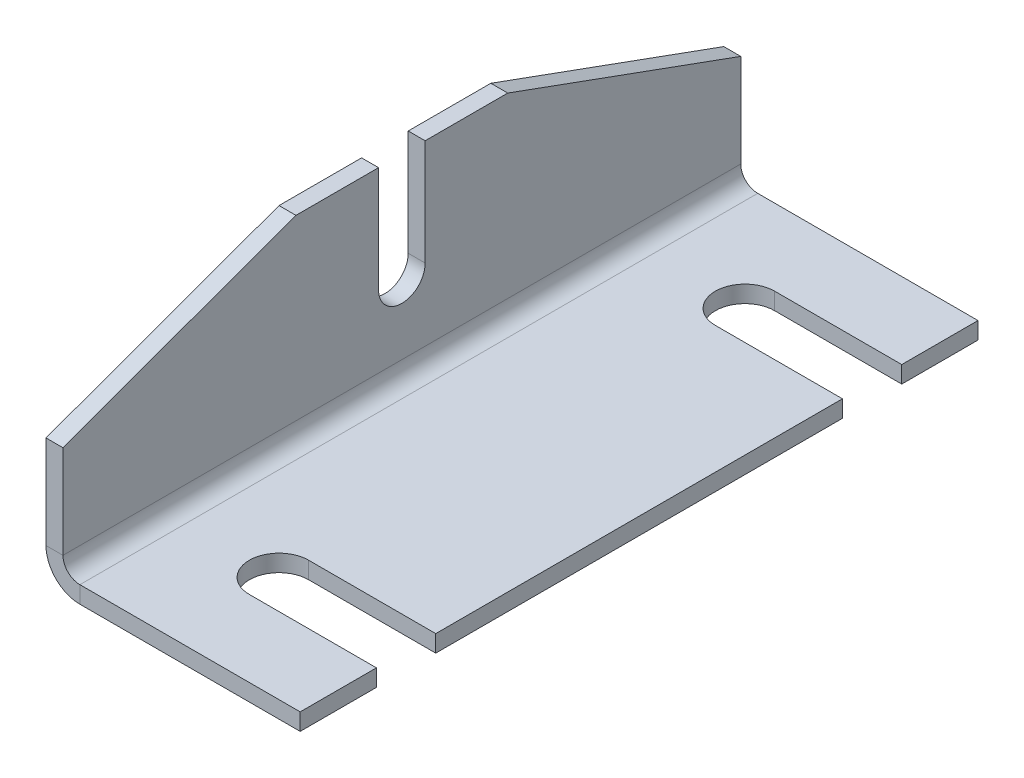
ISO-10303-21;
HEADER;
FILE_DESCRIPTION(('STEP AP214'),'2;1');
FILE_NAME('part.step','',(''),(''),'','','');
FILE_SCHEMA(('AUTOMOTIVE_DESIGN { 1 0 10303 214 1 1 1 1 }'));
ENDSEC;
DATA;
#1=APPLICATION_CONTEXT('core data for automotive mechanical design processes');
#2=APPLICATION_PROTOCOL_DEFINITION('international standard','automotive_design',2000,#1);
#3=PRODUCT_CONTEXT('',#1,'mechanical');
#4=PRODUCT('Part','Part','',(#3));
#5=PRODUCT_RELATED_PRODUCT_CATEGORY('part','',(#4));
#6=PRODUCT_DEFINITION_FORMATION('','',#4);
#7=PRODUCT_DEFINITION_CONTEXT('part definition',#1,'design');
#8=PRODUCT_DEFINITION('design','',#6,#7);
#9=PRODUCT_DEFINITION_SHAPE('','',#8);
#10=(LENGTH_UNIT() NAMED_UNIT(*) SI_UNIT(.MILLI.,.METRE.));
#11=(NAMED_UNIT(*) PLANE_ANGLE_UNIT() SI_UNIT($,.RADIAN.));
#12=(NAMED_UNIT(*) SI_UNIT($,.STERADIAN.) SOLID_ANGLE_UNIT());
#13=UNCERTAINTY_MEASURE_WITH_UNIT(LENGTH_MEASURE(1.E-05),#10,'distance_accuracy_value','');
#14=(GEOMETRIC_REPRESENTATION_CONTEXT(3) GLOBAL_UNCERTAINTY_ASSIGNED_CONTEXT((#13)) GLOBAL_UNIT_ASSIGNED_CONTEXT((#10,
#11,#12)) REPRESENTATION_CONTEXT('',''));
#15=CARTESIAN_POINT('',(0.,0.,0.));
#16=DIRECTION('',(0.,0.,1.));
#17=DIRECTION('',(1.,0.,0.));
#18=AXIS2_PLACEMENT_3D('',#15,#16,#17);
#19=CARTESIAN_POINT('',(60.,4.,80.));
#20=DIRECTION('',(1.,0.,0.));
#21=DIRECTION('',(0.,0.,-1.));
#22=AXIS2_PLACEMENT_3D('',#19,#20,#21);
#23=PLANE('',#22);
#24=DIRECTION('',(0.,1.,0.));
#25=VECTOR('',#24,1.);
#26=CARTESIAN_POINT('',(60.,0.,-48.));
#27=LINE('',#26,#25);
#28=CARTESIAN_POINT('',(60.,0.,-48.));
#29=VERTEX_POINT('',#28);
#30=CARTESIAN_POINT('',(60.,4.,-48.));
#31=VERTEX_POINT('',#30);
#32=EDGE_CURVE('E319',#29,#31,#27,.T.);
#33=ORIENTED_EDGE('',*,*,#32,.T.);
#34=DIRECTION('',(0.,0.,-1.));
#35=VECTOR('',#34,1.);
#36=CARTESIAN_POINT('',(60.,4.,80.));
#37=LINE('',#36,#35);
#38=CARTESIAN_POINT('',(60.,4.,48.));
#39=VERTEX_POINT('',#38);
#40=EDGE_CURVE('E217',#39,#31,#37,.T.);
#41=ORIENTED_EDGE('',*,*,#40,.F.);
#42=DIRECTION('',(0.,1.,0.));
#43=VECTOR('',#42,1.);
#44=CARTESIAN_POINT('',(60.,0.,48.));
#45=LINE('',#44,#43);
#46=CARTESIAN_POINT('',(60.,0.,48.));
#47=VERTEX_POINT('',#46);
#48=EDGE_CURVE('E317',#47,#39,#45,.T.);
#49=ORIENTED_EDGE('',*,*,#48,.F.);
#50=DIRECTION('',(0.,0.,-1.));
#51=VECTOR('',#50,1.);
#52=CARTESIAN_POINT('',(60.,0.,80.));
#53=LINE('',#52,#51);
#54=EDGE_CURVE('E211',#47,#29,#53,.T.);
#55=ORIENTED_EDGE('',*,*,#54,.T.);
#56=EDGE_LOOP('',(#33,#41,#49,#55));
#57=FACE_BOUND('',#56,.T.);
#58=ADVANCED_FACE('F39',(#57),#23,.T.);
#59=DIRECTION('',(0.,1.,0.));
#60=VECTOR('',#59,1.);
#61=CARTESIAN_POINT('',(60.,0.,-62.));
#62=LINE('',#61,#60);
#63=CARTESIAN_POINT('',(60.,0.,-62.));
#64=VERTEX_POINT('',#63);
#65=CARTESIAN_POINT('',(60.,4.,-62.));
#66=VERTEX_POINT('',#65);
#67=EDGE_CURVE('E62',#64,#66,#62,.T.);
#68=ORIENTED_EDGE('',*,*,#67,.F.);
#69=CARTESIAN_POINT('',(60.,0.,-80.));
#70=VERTEX_POINT('',#69);
#71=EDGE_CURVE('E201',#64,#70,#53,.T.);
#72=ORIENTED_EDGE('',*,*,#71,.T.);
#73=DIRECTION('',(0.,-1.,0.));
#74=VECTOR('',#73,1.);
#75=CARTESIAN_POINT('',(60.,4.,-80.));
#76=LINE('',#75,#74);
#77=CARTESIAN_POINT('',(60.,4.,-80.));
#78=VERTEX_POINT('',#77);
#79=EDGE_CURVE('E278',#78,#70,#76,.T.);
#80=ORIENTED_EDGE('',*,*,#79,.F.);
#81=EDGE_CURVE('E203',#66,#78,#37,.T.);
#82=ORIENTED_EDGE('',*,*,#81,.F.);
#83=EDGE_LOOP('',(#68,#72,#80,#82));
#84=FACE_BOUND('',#83,.T.);
#85=ADVANCED_FACE('F199',(#84),#23,.T.);
#86=CARTESIAN_POINT('',(0.,50.,80.));
#87=DIRECTION('',(0.,1.,0.));
#88=DIRECTION('',(0.,0.,1.));
#89=AXIS2_PLACEMENT_3D('',#86,#87,#88);
#90=PLANE('',#89);
#91=DIRECTION('',(1.,0.,0.));
#92=VECTOR('',#91,1.);
#93=CARTESIAN_POINT('',(0.,50.,-25.));
#94=LINE('',#93,#92);
#95=CARTESIAN_POINT('',(0.,50.,-25.));
#96=VERTEX_POINT('',#95);
#97=CARTESIAN_POINT('',(4.,50.,-25.));
#98=VERTEX_POINT('',#97);
#99=EDGE_CURVE('E369',#96,#98,#94,.T.);
#100=ORIENTED_EDGE('',*,*,#99,.F.);
#101=DIRECTION('',(0.,0.,-1.));
#102=VECTOR('',#101,1.);
#103=CARTESIAN_POINT('',(0.,50.,80.));
#104=LINE('',#103,#102);
#105=CARTESIAN_POINT('',(0.,50.,-5.50000000000001));
#106=VERTEX_POINT('',#105);
#107=EDGE_CURVE('E291',#106,#96,#104,.T.);
#108=ORIENTED_EDGE('',*,*,#107,.F.);
#109=DIRECTION('',(1.,0.,0.));
#110=VECTOR('',#109,1.);
#111=CARTESIAN_POINT('',(0.,50.,-5.50000000000001));
#112=LINE('',#111,#110);
#113=CARTESIAN_POINT('',(4.,50.,-5.50000000000001));
#114=VERTEX_POINT('',#113);
#115=EDGE_CURVE('E372',#106,#114,#112,.T.);
#116=ORIENTED_EDGE('',*,*,#115,.T.);
#117=DIRECTION('',(0.,0.,-1.));
#118=VECTOR('',#117,1.);
#119=CARTESIAN_POINT('',(4.,50.,80.));
#120=LINE('',#119,#118);
#121=EDGE_CURVE('E295',#114,#98,#120,.T.);
#122=ORIENTED_EDGE('',*,*,#121,.T.);
#123=EDGE_LOOP('',(#100,#108,#116,#122));
#124=FACE_BOUND('',#123,.T.);
#125=ADVANCED_FACE('F450',(#124),#90,.T.);
#126=CARTESIAN_POINT('',(0.,8.,80.));
#127=DIRECTION('',(0.,0.,1.));
#128=DIRECTION('',(1.,0.,0.));
#129=AXIS2_PLACEMENT_3D('',#126,#127,#128);
#130=PLANE('',#129);
#131=DIRECTION('',(1.,0.,0.));
#132=VECTOR('',#131,1.);
#133=CARTESIAN_POINT('',(0.,8.,80.));
#134=LINE('',#133,#132);
#135=CARTESIAN_POINT('',(0.,8.,80.));
#136=VERTEX_POINT('',#135);
#137=CARTESIAN_POINT('',(4.,8.,80.));
#138=VERTEX_POINT('',#137);
#139=EDGE_CURVE('E11',#136,#138,#134,.T.);
#140=ORIENTED_EDGE('',*,*,#139,.F.);
#141=CARTESIAN_POINT('',(8.,8.,80.));
#142=DIRECTION('',(0.,0.,-1.));
#143=DIRECTION('',(-1.,0.,0.));
#144=AXIS2_PLACEMENT_3D('',#141,#142,#143);
#145=CIRCLE('',#144,8.);
#146=CARTESIAN_POINT('',(8.,0.,80.));
#147=VERTEX_POINT('',#146);
#148=EDGE_CURVE('E248',#136,#147,#145,.F.);
#149=ORIENTED_EDGE('',*,*,#148,.T.);
#150=DIRECTION('',(0.,-1.,0.));
#151=VECTOR('',#150,1.);
#152=CARTESIAN_POINT('',(8.,4.,80.));
#153=LINE('',#152,#151);
#154=CARTESIAN_POINT('',(8.,4.,80.));
#155=VERTEX_POINT('',#154);
#156=EDGE_CURVE('E47',#155,#147,#153,.T.);
#157=ORIENTED_EDGE('',*,*,#156,.F.);
#158=CARTESIAN_POINT('',(8.,8.,80.));
#159=DIRECTION('',(0.,0.,1.));
#160=DIRECTION('',(1.,0.,0.));
#161=AXIS2_PLACEMENT_3D('',#158,#159,#160);
#162=CIRCLE('',#161,4.);
#163=EDGE_CURVE('E272',#138,#155,#162,.T.);
#164=ORIENTED_EDGE('',*,*,#163,.F.);
#165=EDGE_LOOP('',(#140,#149,#157,#164));
#166=FACE_BOUND('',#165,.T.);
#167=ADVANCED_FACE('F41',(#166),#130,.T.);
#168=CARTESIAN_POINT('',(8.,4.,80.));
#169=DIRECTION('',(0.,0.,1.));
#170=DIRECTION('',(1.,0.,0.));
#171=AXIS2_PLACEMENT_3D('',#168,#169,#170);
#172=PLANE('',#171);
#173=DIRECTION('',(1.,0.,0.));
#174=VECTOR('',#173,1.);
#175=CARTESIAN_POINT('',(0.,30.,80.));
#176=LINE('',#175,#174);
#177=CARTESIAN_POINT('',(0.,30.,80.));
#178=VERTEX_POINT('',#177);
#179=CARTESIAN_POINT('',(4.,30.,80.));
#180=VERTEX_POINT('',#179);
#181=EDGE_CURVE('E359',#178,#180,#176,.T.);
#182=ORIENTED_EDGE('',*,*,#181,.F.);
#183=DIRECTION('',(0.,-1.,0.));
#184=VECTOR('',#183,1.);
#185=CARTESIAN_POINT('',(0.,0.,80.));
#186=LINE('',#185,#184);
#187=EDGE_CURVE('E253',#178,#136,#186,.T.);
#188=ORIENTED_EDGE('',*,*,#187,.T.);
#189=ORIENTED_EDGE('',*,*,#139,.T.);
#190=DIRECTION('',(0.,1.,0.));
#191=VECTOR('',#190,1.);
#192=CARTESIAN_POINT('',(4.,0.,80.));
#193=LINE('',#192,#191);
#194=EDGE_CURVE('E274',#180,#138,#193,.F.);
#195=ORIENTED_EDGE('',*,*,#194,.F.);
#196=EDGE_LOOP('',(#182,#188,#189,#195));
#197=FACE_BOUND('',#196,.T.);
#198=ADVANCED_FACE('F417',(#197),#172,.T.);
#199=CARTESIAN_POINT('',(8.,0.,-80.));
#200=DIRECTION('',(0.,0.,-1.));
#201=DIRECTION('',(-1.,0.,0.));
#202=AXIS2_PLACEMENT_3D('',#199,#200,#201);
#203=PLANE('',#202);
#204=DIRECTION('',(0.,1.,0.));
#205=VECTOR('',#204,1.);
#206=CARTESIAN_POINT('',(8.,0.,-80.));
#207=LINE('',#206,#205);
#208=CARTESIAN_POINT('',(8.,0.,-80.));
#209=VERTEX_POINT('',#208);
#210=CARTESIAN_POINT('',(8.,4.,-80.));
#211=VERTEX_POINT('',#210);
#212=EDGE_CURVE('E227',#209,#211,#207,.T.);
#213=ORIENTED_EDGE('',*,*,#212,.F.);
#214=CARTESIAN_POINT('',(8.,8.,-80.));
#215=DIRECTION('',(0.,0.,-1.));
#216=DIRECTION('',(-1.,0.,0.));
#217=AXIS2_PLACEMENT_3D('',#214,#215,#216);
#218=CIRCLE('',#217,8.);
#219=CARTESIAN_POINT('',(0.,8.,-80.));
#220=VERTEX_POINT('',#219);
#221=EDGE_CURVE('E258',#220,#209,#218,.F.);
#222=ORIENTED_EDGE('',*,*,#221,.F.);
#223=DIRECTION('',(-1.,0.,0.));
#224=VECTOR('',#223,1.);
#225=CARTESIAN_POINT('',(4.,8.,-80.));
#226=LINE('',#225,#224);
#227=CARTESIAN_POINT('',(4.,8.,-80.));
#228=VERTEX_POINT('',#227);
#229=EDGE_CURVE('E221',#228,#220,#226,.T.);
#230=ORIENTED_EDGE('',*,*,#229,.F.);
#231=CARTESIAN_POINT('',(8.,8.,-80.));
#232=DIRECTION('',(0.,0.,1.));
#233=DIRECTION('',(1.,0.,0.));
#234=AXIS2_PLACEMENT_3D('',#231,#232,#233);
#235=CIRCLE('',#234,4.);
#236=EDGE_CURVE('E284',#228,#211,#235,.T.);
#237=ORIENTED_EDGE('',*,*,#236,.T.);
#238=EDGE_LOOP('',(#213,#222,#230,#237));
#239=FACE_BOUND('',#238,.T.);
#240=ADVANCED_FACE('F424',(#239),#203,.T.);
#241=CARTESIAN_POINT('',(4.,8.,-80.));
#242=DIRECTION('',(0.,0.,-1.));
#243=DIRECTION('',(-1.,0.,0.));
#244=AXIS2_PLACEMENT_3D('',#241,#242,#243);
#245=PLANE('',#244);
#246=DIRECTION('',(1.,0.,0.));
#247=VECTOR('',#246,1.);
#248=CARTESIAN_POINT('',(0.,0.,-80.));
#249=LINE('',#248,#247);
#250=EDGE_CURVE('E209',#209,#70,#249,.T.);
#251=ORIENTED_EDGE('',*,*,#250,.F.);
#252=ORIENTED_EDGE('',*,*,#212,.T.);
#253=DIRECTION('',(1.,0.,0.));
#254=VECTOR('',#253,1.);
#255=CARTESIAN_POINT('',(0.,4.,-80.));
#256=LINE('',#255,#254);
#257=EDGE_CURVE('E281',#211,#78,#256,.T.);
#258=ORIENTED_EDGE('',*,*,#257,.T.);
#259=ORIENTED_EDGE('',*,*,#79,.T.);
#260=EDGE_LOOP('',(#251,#252,#258,#259));
#261=FACE_BOUND('',#260,.T.);
#262=ADVANCED_FACE('F426',(#261),#245,.T.);
#263=CARTESIAN_POINT('',(0.,0.,80.));
#264=DIRECTION('',(0.,1.,0.));
#265=DIRECTION('',(0.,0.,1.));
#266=AXIS2_PLACEMENT_3D('',#263,#264,#265);
#267=PLANE('',#266);
#268=CARTESIAN_POINT('',(30.,0.,-55.));
#269=DIRECTION('',(0.,1.,0.));
#270=DIRECTION('',(0.,0.,1.));
#271=AXIS2_PLACEMENT_3D('',#268,#269,#270);
#272=CIRCLE('',#271,7.00000000000001);
#273=CARTESIAN_POINT('',(30.,0.,-62.));
#274=VERTEX_POINT('',#273);
#275=CARTESIAN_POINT('',(30.,0.,-48.));
#276=VERTEX_POINT('',#275);
#277=EDGE_CURVE('E194',#274,#276,#272,.T.);
#278=ORIENTED_EDGE('',*,*,#277,.T.);
#279=DIRECTION('',(1.,0.,0.));
#280=VECTOR('',#279,1.);
#281=CARTESIAN_POINT('',(30.,0.,-48.));
#282=LINE('',#281,#280);
#283=EDGE_CURVE('E204',#276,#29,#282,.T.);
#284=ORIENTED_EDGE('',*,*,#283,.T.);
#285=ORIENTED_EDGE('',*,*,#54,.F.);
#286=DIRECTION('',(-1.,0.,0.));
#287=VECTOR('',#286,1.);
#288=CARTESIAN_POINT('',(30.,0.,48.));
#289=LINE('',#288,#287);
#290=CARTESIAN_POINT('',(30.,0.,48.));
#291=VERTEX_POINT('',#290);
#292=EDGE_CURVE('E334',#47,#291,#289,.T.);
#293=ORIENTED_EDGE('',*,*,#292,.T.);
#294=CARTESIAN_POINT('',(30.,0.,55.));
#295=DIRECTION('',(0.,1.,0.));
#296=DIRECTION('',(0.,0.,-1.));
#297=AXIS2_PLACEMENT_3D('',#294,#295,#296);
#298=CIRCLE('',#297,7.00000000000001);
#299=CARTESIAN_POINT('',(30.,0.,62.));
#300=VERTEX_POINT('',#299);
#301=EDGE_CURVE('E337',#291,#300,#298,.T.);
#302=ORIENTED_EDGE('',*,*,#301,.T.);
#303=DIRECTION('',(1.,0.,0.));
#304=VECTOR('',#303,1.);
#305=CARTESIAN_POINT('',(60.,0.,62.));
#306=LINE('',#305,#304);
#307=CARTESIAN_POINT('',(60.,0.,62.));
#308=VERTEX_POINT('',#307);
#309=EDGE_CURVE('E341',#300,#308,#306,.T.);
#310=ORIENTED_EDGE('',*,*,#309,.T.);
#311=CARTESIAN_POINT('',(60.,0.,80.));
#312=VERTEX_POINT('',#311);
#313=EDGE_CURVE('E214',#312,#308,#53,.T.);
#314=ORIENTED_EDGE('',*,*,#313,.F.);
#315=DIRECTION('',(1.,0.,0.));
#316=VECTOR('',#315,1.);
#317=CARTESIAN_POINT('',(0.,0.,80.));
#318=LINE('',#317,#316);
#319=EDGE_CURVE('E239',#147,#312,#318,.T.);
#320=ORIENTED_EDGE('',*,*,#319,.F.);
#321=DIRECTION('',(0.,0.,-1.));
#322=VECTOR('',#321,1.);
#323=CARTESIAN_POINT('',(8.,0.,80.));
#324=LINE('',#323,#322);
#325=EDGE_CURVE('E252',#147,#209,#324,.T.);
#326=ORIENTED_EDGE('',*,*,#325,.T.);
#327=ORIENTED_EDGE('',*,*,#250,.T.);
#328=ORIENTED_EDGE('',*,*,#71,.F.);
#329=DIRECTION('',(-1.,0.,0.));
#330=VECTOR('',#329,1.);
#331=CARTESIAN_POINT('',(60.,0.,-62.));
#332=LINE('',#331,#330);
#333=EDGE_CURVE('E187',#64,#274,#332,.T.);
#334=ORIENTED_EDGE('',*,*,#333,.T.);
#335=EDGE_LOOP('',(#278,#284,#285,#293,#302,#310,#314,#320,#326,#327,#328,#334));
#336=FACE_BOUND('',#335,.T.);
#337=ADVANCED_FACE('F206',(#336),#267,.F.);
#338=DIRECTION('',(0.,1.,0.));
#339=VECTOR('',#338,1.);
#340=CARTESIAN_POINT('',(60.,0.,62.));
#341=LINE('',#340,#339);
#342=CARTESIAN_POINT('',(60.,4.,62.));
#343=VERTEX_POINT('',#342);
#344=EDGE_CURVE('E351',#308,#343,#341,.T.);
#345=ORIENTED_EDGE('',*,*,#344,.T.);
#346=CARTESIAN_POINT('',(60.,4.,80.));
#347=VERTEX_POINT('',#346);
#348=EDGE_CURVE('E212',#347,#343,#37,.T.);
#349=ORIENTED_EDGE('',*,*,#348,.F.);
#350=DIRECTION('',(0.,-1.,0.));
#351=VECTOR('',#350,1.);
#352=CARTESIAN_POINT('',(60.,4.,80.));
#353=LINE('',#352,#351);
#354=EDGE_CURVE('E262',#347,#312,#353,.T.);
#355=ORIENTED_EDGE('',*,*,#354,.T.);
#356=ORIENTED_EDGE('',*,*,#313,.T.);
#357=EDGE_LOOP('',(#345,#349,#355,#356));
#358=FACE_BOUND('',#357,.T.);
#359=ADVANCED_FACE('F428',(#358),#23,.T.);
#360=CARTESIAN_POINT('',(0.,4.,80.));
#361=DIRECTION('',(0.,1.,0.));
#362=DIRECTION('',(0.,0.,1.));
#363=AXIS2_PLACEMENT_3D('',#360,#361,#362);
#364=PLANE('',#363);
#365=DIRECTION('',(1.,0.,0.));
#366=VECTOR('',#365,1.);
#367=CARTESIAN_POINT('',(30.,4.,-48.));
#368=LINE('',#367,#366);
#369=CARTESIAN_POINT('',(30.,4.,-48.));
#370=VERTEX_POINT('',#369);
#371=EDGE_CURVE('E195',#370,#31,#368,.T.);
#372=ORIENTED_EDGE('',*,*,#371,.F.);
#373=CARTESIAN_POINT('',(30.,4.,-55.));
#374=DIRECTION('',(0.,1.,0.));
#375=DIRECTION('',(0.,0.,1.));
#376=AXIS2_PLACEMENT_3D('',#373,#374,#375);
#377=CIRCLE('',#376,7.00000000000001);
#378=CARTESIAN_POINT('',(30.,4.,-62.));
#379=VERTEX_POINT('',#378);
#380=EDGE_CURVE('E727',#379,#370,#377,.T.);
#381=ORIENTED_EDGE('',*,*,#380,.F.);
#382=DIRECTION('',(-1.,0.,0.));
#383=VECTOR('',#382,1.);
#384=CARTESIAN_POINT('',(60.,4.,-62.));
#385=LINE('',#384,#383);
#386=EDGE_CURVE('E350',#66,#379,#385,.T.);
#387=ORIENTED_EDGE('',*,*,#386,.F.);
#388=ORIENTED_EDGE('',*,*,#81,.T.);
#389=ORIENTED_EDGE('',*,*,#257,.F.);
#390=DIRECTION('',(0.,0.,-1.));
#391=VECTOR('',#390,1.);
#392=CARTESIAN_POINT('',(8.,4.,80.));
#393=LINE('',#392,#391);
#394=EDGE_CURVE('E302',#155,#211,#393,.T.);
#395=ORIENTED_EDGE('',*,*,#394,.F.);
#396=DIRECTION('',(1.,0.,0.));
#397=VECTOR('',#396,1.);
#398=CARTESIAN_POINT('',(0.,4.,80.));
#399=LINE('',#398,#397);
#400=EDGE_CURVE('E241',#155,#347,#399,.T.);
#401=ORIENTED_EDGE('',*,*,#400,.T.);
#402=ORIENTED_EDGE('',*,*,#348,.T.);
#403=DIRECTION('',(1.,0.,0.));
#404=VECTOR('',#403,1.);
#405=CARTESIAN_POINT('',(60.,4.,62.));
#406=LINE('',#405,#404);
#407=CARTESIAN_POINT('',(30.,4.,62.));
#408=VERTEX_POINT('',#407);
#409=EDGE_CURVE('E338',#408,#343,#406,.T.);
#410=ORIENTED_EDGE('',*,*,#409,.F.);
#411=CARTESIAN_POINT('',(30.,4.,55.));
#412=DIRECTION('',(0.,1.,0.));
#413=DIRECTION('',(0.,0.,-1.));
#414=AXIS2_PLACEMENT_3D('',#411,#412,#413);
#415=CIRCLE('',#414,7.00000000000001);
#416=CARTESIAN_POINT('',(30.,4.,48.));
#417=VERTEX_POINT('',#416);
#418=EDGE_CURVE('E345',#417,#408,#415,.T.);
#419=ORIENTED_EDGE('',*,*,#418,.F.);
#420=DIRECTION('',(-1.,0.,0.));
#421=VECTOR('',#420,1.);
#422=CARTESIAN_POINT('',(30.,4.,48.));
#423=LINE('',#422,#421);
#424=EDGE_CURVE('E54',#39,#417,#423,.T.);
#425=ORIENTED_EDGE('',*,*,#424,.F.);
#426=ORIENTED_EDGE('',*,*,#40,.T.);
#427=EDGE_LOOP('',(#372,#381,#387,#388,#389,#395,#401,#402,#410,#419,#425,#426));
#428=FACE_BOUND('',#427,.T.);
#429=ADVANCED_FACE('F311',(#428),#364,.T.);
#430=CARTESIAN_POINT('',(8.,8.,80.));
#431=DIRECTION('',(0.,0.,-1.));
#432=DIRECTION('',(-1.,0.,0.));
#433=AXIS2_PLACEMENT_3D('',#430,#431,#432);
#434=CYLINDRICAL_SURFACE('',#433,4.);
#435=ORIENTED_EDGE('',*,*,#236,.F.);
#436=DIRECTION('',(0.,0.,-1.));
#437=VECTOR('',#436,1.);
#438=CARTESIAN_POINT('',(4.,8.,80.));
#439=LINE('',#438,#437);
#440=EDGE_CURVE('E299',#138,#228,#439,.T.);
#441=ORIENTED_EDGE('',*,*,#440,.F.);
#442=ORIENTED_EDGE('',*,*,#163,.T.);
#443=ORIENTED_EDGE('',*,*,#394,.T.);
#444=EDGE_LOOP('',(#435,#441,#442,#443));
#445=FACE_BOUND('',#444,.T.);
#446=ADVANCED_FACE('F422',(#445),#434,.F.);
#447=CARTESIAN_POINT('',(4.,0.,80.));
#448=DIRECTION('',(1.,0.,0.));
#449=DIRECTION('',(0.,0.,-1.));
#450=AXIS2_PLACEMENT_3D('',#447,#448,#449);
#451=PLANE('',#450);
#452=DIRECTION('',(0.,0.341743063086704,-0.939793423488437));
#453=VECTOR('',#452,1.);
#454=CARTESIAN_POINT('',(4.,30.,80.));
#455=LINE('',#454,#453);
#456=CARTESIAN_POINT('',(4.,50.,25.));
#457=VERTEX_POINT('',#456);
#458=EDGE_CURVE('E360',#180,#457,#455,.T.);
#459=ORIENTED_EDGE('',*,*,#458,.F.);
#460=ORIENTED_EDGE('',*,*,#194,.T.);
#461=ORIENTED_EDGE('',*,*,#440,.T.);
#462=DIRECTION('',(0.,1.,0.));
#463=VECTOR('',#462,1.);
#464=CARTESIAN_POINT('',(4.,0.,-80.));
#465=LINE('',#464,#463);
#466=CARTESIAN_POINT('',(4.,30.,-80.));
#467=VERTEX_POINT('',#466);
#468=EDGE_CURVE('E287',#467,#228,#465,.F.);
#469=ORIENTED_EDGE('',*,*,#468,.F.);
#470=DIRECTION('',(0.,-0.341743063086704,-0.939793423488437));
#471=VECTOR('',#470,1.);
#472=CARTESIAN_POINT('',(4.,30.,-80.));
#473=LINE('',#472,#471);
#474=EDGE_CURVE('E370',#98,#467,#473,.T.);
#475=ORIENTED_EDGE('',*,*,#474,.F.);
#476=ORIENTED_EDGE('',*,*,#121,.F.);
#477=DIRECTION('',(0.,1.,0.));
#478=VECTOR('',#477,1.);
#479=CARTESIAN_POINT('',(4.,25.,-5.5));
#480=LINE('',#479,#478);
#481=CARTESIAN_POINT('',(4.,25.,-5.5));
#482=VERTEX_POINT('',#481);
#483=EDGE_CURVE('E380',#482,#114,#480,.T.);
#484=ORIENTED_EDGE('',*,*,#483,.F.);
#485=CARTESIAN_POINT('',(4.,25.,0.));
#486=DIRECTION('',(1.,0.,0.));
#487=DIRECTION('',(0.,0.,-1.));
#488=AXIS2_PLACEMENT_3D('',#485,#486,#487);
#489=CIRCLE('',#488,5.5);
#490=CARTESIAN_POINT('',(4.,25.,5.5));
#491=VERTEX_POINT('',#490);
#492=EDGE_CURVE('E327',#491,#482,#489,.T.);
#493=ORIENTED_EDGE('',*,*,#492,.F.);
#494=DIRECTION('',(0.,-1.,0.));
#495=VECTOR('',#494,1.);
#496=CARTESIAN_POINT('',(4.,50.,5.50000000000001));
#497=LINE('',#496,#495);
#498=CARTESIAN_POINT('',(4.,50.,5.50000000000001));
#499=VERTEX_POINT('',#498);
#500=EDGE_CURVE('E323',#499,#491,#497,.T.);
#501=ORIENTED_EDGE('',*,*,#500,.F.);
#502=EDGE_CURVE('E298',#457,#499,#120,.T.);
#503=ORIENTED_EDGE('',*,*,#502,.F.);
#504=EDGE_LOOP('',(#459,#460,#461,#469,#475,#476,#484,#493,#501,#503));
#505=FACE_BOUND('',#504,.T.);
#506=ADVANCED_FACE('F407',(#505),#451,.T.);
#507=DIRECTION('',(1.,0.,0.));
#508=VECTOR('',#507,1.);
#509=CARTESIAN_POINT('',(0.,50.,25.));
#510=LINE('',#509,#508);
#511=CARTESIAN_POINT('',(0.,50.,25.));
#512=VERTEX_POINT('',#511);
#513=EDGE_CURVE('E279',#512,#457,#510,.T.);
#514=ORIENTED_EDGE('',*,*,#513,.T.);
#515=ORIENTED_EDGE('',*,*,#502,.T.);
#516=DIRECTION('',(1.,0.,0.));
#517=VECTOR('',#516,1.);
#518=CARTESIAN_POINT('',(0.,50.,5.50000000000001));
#519=LINE('',#518,#517);
#520=CARTESIAN_POINT('',(0.,50.,5.50000000000001));
#521=VERTEX_POINT('',#520);
#522=EDGE_CURVE('E268',#521,#499,#519,.T.);
#523=ORIENTED_EDGE('',*,*,#522,.F.);
#524=EDGE_CURVE('E294',#512,#521,#104,.T.);
#525=ORIENTED_EDGE('',*,*,#524,.F.);
#526=EDGE_LOOP('',(#514,#515,#523,#525));
#527=FACE_BOUND('',#526,.T.);
#528=ADVANCED_FACE('F409',(#527),#90,.T.);
#529=CARTESIAN_POINT('',(0.,0.,80.));
#530=DIRECTION('',(1.,0.,0.));
#531=DIRECTION('',(0.,0.,-1.));
#532=AXIS2_PLACEMENT_3D('',#529,#530,#531);
#533=PLANE('',#532);
#534=ORIENTED_EDGE('',*,*,#187,.F.);
#535=DIRECTION('',(0.,0.341743063086704,-0.939793423488437));
#536=VECTOR('',#535,1.);
#537=CARTESIAN_POINT('',(0.,30.,80.));
#538=LINE('',#537,#536);
#539=EDGE_CURVE('E356',#178,#512,#538,.T.);
#540=ORIENTED_EDGE('',*,*,#539,.T.);
#541=ORIENTED_EDGE('',*,*,#524,.T.);
#542=DIRECTION('',(0.,-1.,0.));
#543=VECTOR('',#542,1.);
#544=CARTESIAN_POINT('',(0.,50.,5.50000000000001));
#545=LINE('',#544,#543);
#546=CARTESIAN_POINT('',(0.,25.,5.5));
#547=VERTEX_POINT('',#546);
#548=EDGE_CURVE('E376',#521,#547,#545,.T.);
#549=ORIENTED_EDGE('',*,*,#548,.T.);
#550=CARTESIAN_POINT('',(0.,25.,0.));
#551=DIRECTION('',(1.,0.,0.));
#552=DIRECTION('',(0.,0.,-1.));
#553=AXIS2_PLACEMENT_3D('',#550,#551,#552);
#554=CIRCLE('',#553,5.5);
#555=CARTESIAN_POINT('',(0.,25.,-5.5));
#556=VERTEX_POINT('',#555);
#557=EDGE_CURVE('E379',#547,#556,#554,.T.);
#558=ORIENTED_EDGE('',*,*,#557,.T.);
#559=DIRECTION('',(0.,1.,0.));
#560=VECTOR('',#559,1.);
#561=CARTESIAN_POINT('',(0.,25.,-5.5));
#562=LINE('',#561,#560);
#563=EDGE_CURVE('E383',#556,#106,#562,.T.);
#564=ORIENTED_EDGE('',*,*,#563,.T.);
#565=ORIENTED_EDGE('',*,*,#107,.T.);
#566=DIRECTION('',(0.,-0.341743063086704,-0.939793423488437));
#567=VECTOR('',#566,1.);
#568=CARTESIAN_POINT('',(0.,30.,-80.));
#569=LINE('',#568,#567);
#570=CARTESIAN_POINT('',(0.,30.,-80.));
#571=VERTEX_POINT('',#570);
#572=EDGE_CURVE('E366',#96,#571,#569,.T.);
#573=ORIENTED_EDGE('',*,*,#572,.T.);
#574=DIRECTION('',(0.,-1.,0.));
#575=VECTOR('',#574,1.);
#576=CARTESIAN_POINT('',(0.,0.,-80.));
#577=LINE('',#576,#575);
#578=EDGE_CURVE('E265',#571,#220,#577,.T.);
#579=ORIENTED_EDGE('',*,*,#578,.T.);
#580=DIRECTION('',(0.,0.,-1.));
#581=VECTOR('',#580,1.);
#582=CARTESIAN_POINT('',(0.,8.,80.));
#583=LINE('',#582,#581);
#584=EDGE_CURVE('E259',#136,#220,#583,.T.);
#585=ORIENTED_EDGE('',*,*,#584,.F.);
#586=EDGE_LOOP('',(#534,#540,#541,#549,#558,#564,#565,#573,#579,#585));
#587=FACE_BOUND('',#586,.T.);
#588=ADVANCED_FACE('F415',(#587),#533,.F.);
#589=CARTESIAN_POINT('',(8.,8.,80.));
#590=DIRECTION('',(0.,0.,-1.));
#591=DIRECTION('',(-1.,0.,0.));
#592=AXIS2_PLACEMENT_3D('',#589,#590,#591);
#593=CYLINDRICAL_SURFACE('',#592,8.);
#594=ORIENTED_EDGE('',*,*,#221,.T.);
#595=ORIENTED_EDGE('',*,*,#325,.F.);
#596=ORIENTED_EDGE('',*,*,#148,.F.);
#597=ORIENTED_EDGE('',*,*,#584,.T.);
#598=EDGE_LOOP('',(#594,#595,#596,#597));
#599=FACE_BOUND('',#598,.T.);
#600=ADVANCED_FACE('F256',(#599),#593,.T.);
#601=CARTESIAN_POINT('',(8.,8.,80.));
#602=DIRECTION('',(0.,0.,1.));
#603=DIRECTION('',(1.,0.,0.));
#604=AXIS2_PLACEMENT_3D('',#601,#602,#603);
#605=PLANE('',#604);
#606=ORIENTED_EDGE('',*,*,#319,.T.);
#607=ORIENTED_EDGE('',*,*,#354,.F.);
#608=ORIENTED_EDGE('',*,*,#400,.F.);
#609=ORIENTED_EDGE('',*,*,#156,.T.);
#610=EDGE_LOOP('',(#606,#607,#608,#609));
#611=FACE_BOUND('',#610,.T.);
#612=ADVANCED_FACE('F236',(#611),#605,.T.);
#613=CARTESIAN_POINT('',(8.,8.,-80.));
#614=DIRECTION('',(0.,0.,1.));
#615=DIRECTION('',(1.,0.,0.));
#616=AXIS2_PLACEMENT_3D('',#613,#614,#615);
#617=PLANE('',#616);
#618=ORIENTED_EDGE('',*,*,#578,.F.);
#619=DIRECTION('',(1.,0.,0.));
#620=VECTOR('',#619,1.);
#621=CARTESIAN_POINT('',(0.,30.,-80.));
#622=LINE('',#621,#620);
#623=EDGE_CURVE('E362',#571,#467,#622,.T.);
#624=ORIENTED_EDGE('',*,*,#623,.T.);
#625=ORIENTED_EDGE('',*,*,#468,.T.);
#626=ORIENTED_EDGE('',*,*,#229,.T.);
#627=EDGE_LOOP('',(#618,#624,#625,#626));
#628=FACE_BOUND('',#627,.T.);
#629=ADVANCED_FACE('F609',(#628),#617,.F.);
#630=CARTESIAN_POINT('',(0.,30.,-80.));
#631=DIRECTION('',(0.,-0.939793423488437,0.341743063086704));
#632=DIRECTION('',(0.,-0.341743063086704,-0.939793423488437));
#633=AXIS2_PLACEMENT_3D('',#630,#631,#632);
#634=PLANE('',#633);
#635=ORIENTED_EDGE('',*,*,#474,.T.);
#636=ORIENTED_EDGE('',*,*,#623,.F.);
#637=ORIENTED_EDGE('',*,*,#572,.F.);
#638=ORIENTED_EDGE('',*,*,#99,.T.);
#639=EDGE_LOOP('',(#635,#636,#637,#638));
#640=FACE_BOUND('',#639,.T.);
#641=ADVANCED_FACE('F599',(#640),#634,.F.);
#642=CARTESIAN_POINT('',(0.,25.,-5.5));
#643=DIRECTION('',(0.,0.,-1.));
#644=DIRECTION('',(0.,1.,0.));
#645=AXIS2_PLACEMENT_3D('',#642,#643,#644);
#646=PLANE('',#645);
#647=ORIENTED_EDGE('',*,*,#483,.T.);
#648=ORIENTED_EDGE('',*,*,#115,.F.);
#649=ORIENTED_EDGE('',*,*,#563,.F.);
#650=DIRECTION('',(1.,0.,0.));
#651=VECTOR('',#650,1.);
#652=CARTESIAN_POINT('',(0.,25.,-5.5));
#653=LINE('',#652,#651);
#654=EDGE_CURVE('E391',#556,#482,#653,.T.);
#655=ORIENTED_EDGE('',*,*,#654,.T.);
#656=EDGE_LOOP('',(#647,#648,#649,#655));
#657=FACE_BOUND('',#656,.T.);
#658=ADVANCED_FACE('F590',(#657),#646,.F.);
#659=CARTESIAN_POINT('',(0.,25.,0.));
#660=DIRECTION('',(1.,0.,0.));
#661=DIRECTION('',(0.,0.,-1.));
#662=AXIS2_PLACEMENT_3D('',#659,#660,#661);
#663=CYLINDRICAL_SURFACE('',#662,5.5);
#664=ORIENTED_EDGE('',*,*,#492,.T.);
#665=ORIENTED_EDGE('',*,*,#654,.F.);
#666=ORIENTED_EDGE('',*,*,#557,.F.);
#667=DIRECTION('',(1.,0.,0.));
#668=VECTOR('',#667,1.);
#669=CARTESIAN_POINT('',(0.,25.,5.5));
#670=LINE('',#669,#668);
#671=EDGE_CURVE('E392',#547,#491,#670,.T.);
#672=ORIENTED_EDGE('',*,*,#671,.T.);
#673=EDGE_LOOP('',(#664,#665,#666,#672));
#674=FACE_BOUND('',#673,.T.);
#675=ADVANCED_FACE('F581',(#674),#663,.F.);
#676=CARTESIAN_POINT('',(0.,50.,5.50000000000001));
#677=DIRECTION('',(0.,0.,1.));
#678=DIRECTION('',(0.,-1.,0.));
#679=AXIS2_PLACEMENT_3D('',#676,#677,#678);
#680=PLANE('',#679);
#681=ORIENTED_EDGE('',*,*,#500,.T.);
#682=ORIENTED_EDGE('',*,*,#671,.F.);
#683=ORIENTED_EDGE('',*,*,#548,.F.);
#684=ORIENTED_EDGE('',*,*,#522,.T.);
#685=EDGE_LOOP('',(#681,#682,#683,#684));
#686=FACE_BOUND('',#685,.T.);
#687=ADVANCED_FACE('F398',(#686),#680,.F.);
#688=CARTESIAN_POINT('',(0.,30.,80.));
#689=DIRECTION('',(0.,-0.939793423488437,-0.341743063086704));
#690=DIRECTION('',(0.,0.341743063086704,-0.939793423488437));
#691=AXIS2_PLACEMENT_3D('',#688,#689,#690);
#692=PLANE('',#691);
#693=ORIENTED_EDGE('',*,*,#458,.T.);
#694=ORIENTED_EDGE('',*,*,#513,.F.);
#695=ORIENTED_EDGE('',*,*,#539,.F.);
#696=ORIENTED_EDGE('',*,*,#181,.T.);
#697=EDGE_LOOP('',(#693,#694,#695,#696));
#698=FACE_BOUND('',#697,.T.);
#699=ADVANCED_FACE('F411',(#698),#692,.F.);
#700=CARTESIAN_POINT('',(30.,0.,48.));
#701=DIRECTION('',(0.,0.,-1.));
#702=DIRECTION('',(-1.,0.,0.));
#703=AXIS2_PLACEMENT_3D('',#700,#701,#702);
#704=PLANE('',#703);
#705=ORIENTED_EDGE('',*,*,#424,.T.);
#706=DIRECTION('',(0.,1.,0.));
#707=VECTOR('',#706,1.);
#708=CARTESIAN_POINT('',(30.,0.,48.));
#709=LINE('',#708,#707);
#710=EDGE_CURVE('E343',#291,#417,#709,.T.);
#711=ORIENTED_EDGE('',*,*,#710,.F.);
#712=ORIENTED_EDGE('',*,*,#292,.F.);
#713=ORIENTED_EDGE('',*,*,#48,.T.);
#714=EDGE_LOOP('',(#705,#711,#712,#713));
#715=FACE_BOUND('',#714,.T.);
#716=ADVANCED_FACE('F435',(#715),#704,.F.);
#717=CARTESIAN_POINT('',(60.,0.,62.));
#718=DIRECTION('',(0.,0.,1.));
#719=DIRECTION('',(1.,0.,0.));
#720=AXIS2_PLACEMENT_3D('',#717,#718,#719);
#721=PLANE('',#720);
#722=ORIENTED_EDGE('',*,*,#409,.T.);
#723=ORIENTED_EDGE('',*,*,#344,.F.);
#724=ORIENTED_EDGE('',*,*,#309,.F.);
#725=DIRECTION('',(0.,1.,0.));
#726=VECTOR('',#725,1.);
#727=CARTESIAN_POINT('',(30.,0.,62.));
#728=LINE('',#727,#726);
#729=EDGE_CURVE('E353',#300,#408,#728,.T.);
#730=ORIENTED_EDGE('',*,*,#729,.T.);
#731=EDGE_LOOP('',(#722,#723,#724,#730));
#732=FACE_BOUND('',#731,.T.);
#733=ADVANCED_FACE('F431',(#732),#721,.F.);
#734=CARTESIAN_POINT('',(30.,0.,55.));
#735=DIRECTION('',(0.,1.,0.));
#736=DIRECTION('',(0.,0.,1.));
#737=AXIS2_PLACEMENT_3D('',#734,#735,#736);
#738=CYLINDRICAL_SURFACE('',#737,7.00000000000001);
#739=ORIENTED_EDGE('',*,*,#418,.T.);
#740=ORIENTED_EDGE('',*,*,#729,.F.);
#741=ORIENTED_EDGE('',*,*,#301,.F.);
#742=ORIENTED_EDGE('',*,*,#710,.T.);
#743=EDGE_LOOP('',(#739,#740,#741,#742));
#744=FACE_BOUND('',#743,.T.);
#745=ADVANCED_FACE('F434',(#744),#738,.F.);
#746=CARTESIAN_POINT('',(30.,0.,-48.));
#747=DIRECTION('',(0.,0.,1.));
#748=DIRECTION('',(1.,0.,0.));
#749=AXIS2_PLACEMENT_3D('',#746,#747,#748);
#750=PLANE('',#749);
#751=ORIENTED_EDGE('',*,*,#371,.T.);
#752=ORIENTED_EDGE('',*,*,#32,.F.);
#753=ORIENTED_EDGE('',*,*,#283,.F.);
#754=DIRECTION('',(0.,1.,0.));
#755=VECTOR('',#754,1.);
#756=CARTESIAN_POINT('',(30.,0.,-48.));
#757=LINE('',#756,#755);
#758=EDGE_CURVE('E324',#276,#370,#757,.T.);
#759=ORIENTED_EDGE('',*,*,#758,.T.);
#760=EDGE_LOOP('',(#751,#752,#753,#759));
#761=FACE_BOUND('',#760,.T.);
#762=ADVANCED_FACE('F520',(#761),#750,.F.);
#763=CARTESIAN_POINT('',(30.,0.,-55.));
#764=DIRECTION('',(0.,1.,0.));
#765=DIRECTION('',(0.,0.,1.));
#766=AXIS2_PLACEMENT_3D('',#763,#764,#765);
#767=CYLINDRICAL_SURFACE('',#766,7.00000000000001);
#768=ORIENTED_EDGE('',*,*,#380,.T.);
#769=ORIENTED_EDGE('',*,*,#758,.F.);
#770=ORIENTED_EDGE('',*,*,#277,.F.);
#771=DIRECTION('',(0.,1.,0.));
#772=VECTOR('',#771,1.);
#773=CARTESIAN_POINT('',(30.,0.,-62.));
#774=LINE('',#773,#772);
#775=EDGE_CURVE('E189',#274,#379,#774,.T.);
#776=ORIENTED_EDGE('',*,*,#775,.T.);
#777=EDGE_LOOP('',(#768,#769,#770,#776));
#778=FACE_BOUND('',#777,.T.);
#779=ADVANCED_FACE('F529',(#778),#767,.F.);
#780=CARTESIAN_POINT('',(60.,0.,-62.));
#781=DIRECTION('',(0.,0.,-1.));
#782=DIRECTION('',(-1.,0.,0.));
#783=AXIS2_PLACEMENT_3D('',#780,#781,#782);
#784=PLANE('',#783);
#785=ORIENTED_EDGE('',*,*,#386,.T.);
#786=ORIENTED_EDGE('',*,*,#775,.F.);
#787=ORIENTED_EDGE('',*,*,#333,.F.);
#788=ORIENTED_EDGE('',*,*,#67,.T.);
#789=EDGE_LOOP('',(#785,#786,#787,#788));
#790=FACE_BOUND('',#789,.T.);
#791=ADVANCED_FACE('F188',(#790),#784,.F.);
#792=CLOSED_SHELL('',(#58,#85,#125,#167,#198,#240,#262,#337,#359,#429,#446,#506,#528,#588,#600,
#612,#629,#641,#658,#675,#687,#699,#716,#733,#745,#762,#779,#791));
#793=MANIFOLD_SOLID_BREP('B2',#792);
#794=ADVANCED_BREP_SHAPE_REPRESENTATION('',(#18,#793),#14);
#795=SHAPE_DEFINITION_REPRESENTATION(#9,#794);
ENDSEC;
END-ISO-10303-21;
